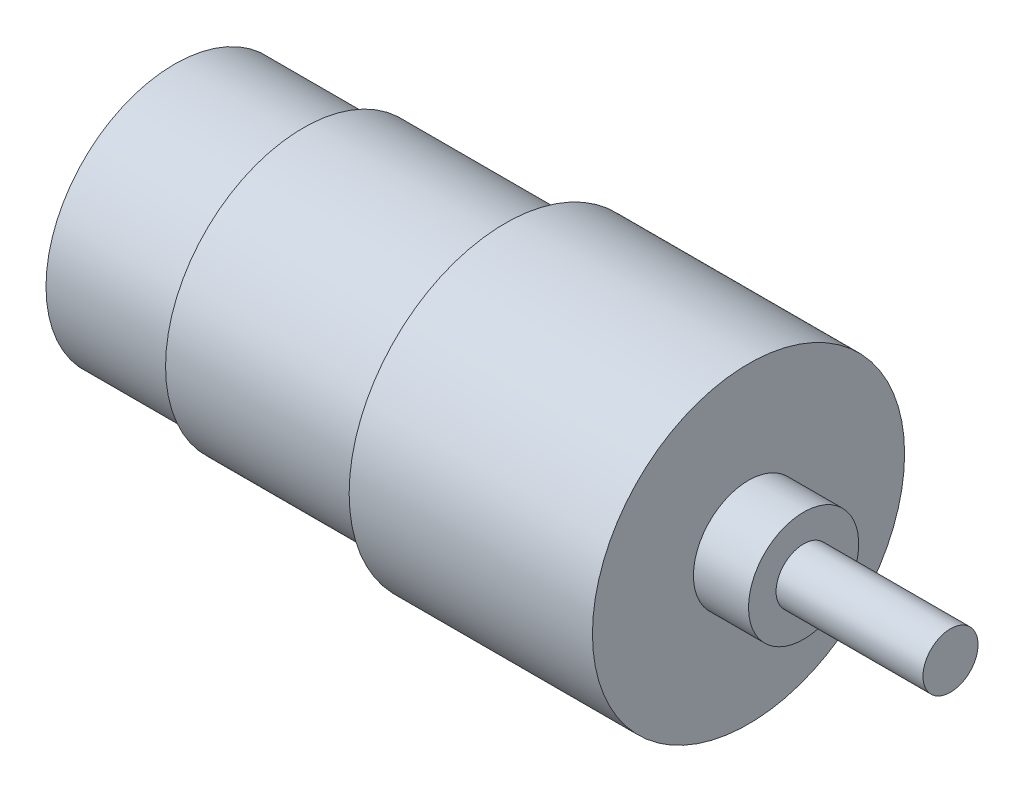
ISO-10303-21;
HEADER;
FILE_DESCRIPTION(('STEP AP214'),'2;1');
FILE_NAME('part.step','',(''),(''),'','','');
FILE_SCHEMA(('AUTOMOTIVE_DESIGN { 1 0 10303 214 1 1 1 1 }'));
ENDSEC;
DATA;
#1=APPLICATION_CONTEXT('core data for automotive mechanical design processes');
#2=APPLICATION_PROTOCOL_DEFINITION('international standard','automotive_design',2000,#1);
#3=PRODUCT_CONTEXT('',#1,'mechanical');
#4=PRODUCT('Part','Part','',(#3));
#5=PRODUCT_RELATED_PRODUCT_CATEGORY('part','',(#4));
#6=PRODUCT_DEFINITION_FORMATION('','',#4);
#7=PRODUCT_DEFINITION_CONTEXT('part definition',#1,'design');
#8=PRODUCT_DEFINITION('design','',#6,#7);
#9=PRODUCT_DEFINITION_SHAPE('','',#8);
#10=(LENGTH_UNIT() NAMED_UNIT(*) SI_UNIT(.MILLI.,.METRE.));
#11=(NAMED_UNIT(*) PLANE_ANGLE_UNIT() SI_UNIT($,.RADIAN.));
#12=(NAMED_UNIT(*) SI_UNIT($,.STERADIAN.) SOLID_ANGLE_UNIT());
#13=UNCERTAINTY_MEASURE_WITH_UNIT(LENGTH_MEASURE(1.E-05),#10,'distance_accuracy_value','');
#14=(GEOMETRIC_REPRESENTATION_CONTEXT(3) GLOBAL_UNCERTAINTY_ASSIGNED_CONTEXT((#13)) GLOBAL_UNIT_ASSIGNED_CONTEXT((#10,
#11,#12)) REPRESENTATION_CONTEXT('',''));
#15=CARTESIAN_POINT('',(0.,0.,0.));
#16=DIRECTION('',(0.,0.,1.));
#17=DIRECTION('',(1.,0.,0.));
#18=AXIS2_PLACEMENT_3D('',#15,#16,#17);
#19=CARTESIAN_POINT('',(0.,0.,0.));
#20=DIRECTION('',(1.,0.,0.));
#21=DIRECTION('',(0.,0.,-1.));
#22=AXIS2_PLACEMENT_3D('',#19,#20,#21);
#23=PLANE('',#22);
#24=CARTESIAN_POINT('',(0.,0.,0.));
#25=DIRECTION('',(-1.,0.,0.));
#26=DIRECTION('',(0.,0.,1.));
#27=AXIS2_PLACEMENT_3D('',#24,#25,#26);
#28=CIRCLE('',#27,14.);
#29=CARTESIAN_POINT('',(0.,0.,14.));
#30=VERTEX_POINT('',#29);
#31=EDGE_CURVE('E10',#30,#30,#28,.T.);
#32=ORIENTED_EDGE('',*,*,#31,.T.);
#33=EDGE_LOOP('',(#32));
#34=FACE_BOUND('',#33,.T.);
#35=ADVANCED_FACE('F37',(#34),#23,.F.);
#36=CARTESIAN_POINT('',(-18.6529126213592,0.,0.));
#37=DIRECTION('',(-1.,0.,0.));
#38=DIRECTION('',(0.,0.,1.));
#39=AXIS2_PLACEMENT_3D('',#36,#37,#38);
#40=CYLINDRICAL_SURFACE('',#39,14.);
#41=ORIENTED_EDGE('',*,*,#31,.F.);
#42=EDGE_LOOP('',(#41));
#43=FACE_BOUND('',#42,.T.);
#44=CARTESIAN_POINT('',(14.0218446601942,0.,0.));
#45=DIRECTION('',(-1.,0.,0.));
#46=DIRECTION('',(0.,0.,1.));
#47=AXIS2_PLACEMENT_3D('',#44,#45,#46);
#48=CIRCLE('',#47,14.);
#49=CARTESIAN_POINT('',(14.0218446601942,0.,14.));
#50=VERTEX_POINT('',#49);
#51=EDGE_CURVE('E44',#50,#50,#48,.T.);
#52=ORIENTED_EDGE('',*,*,#51,.T.);
#53=EDGE_LOOP('',(#52));
#54=FACE_BOUND('',#53,.T.);
#55=ADVANCED_FACE('F97',(#43,#54),#40,.T.);
#56=CARTESIAN_POINT('',(14.0218446601942,0.,-14.));
#57=DIRECTION('',(1.,0.,0.));
#58=DIRECTION('',(0.,0.,-1.));
#59=AXIS2_PLACEMENT_3D('',#56,#57,#58);
#60=PLANE('',#59);
#61=ORIENTED_EDGE('',*,*,#51,.F.);
#62=EDGE_LOOP('',(#61));
#63=FACE_BOUND('',#62,.T.);
#64=CARTESIAN_POINT('',(14.0218446601942,0.,0.));
#65=DIRECTION('',(-1.,0.,0.));
#66=DIRECTION('',(0.,0.,1.));
#67=AXIS2_PLACEMENT_3D('',#64,#65,#66);
#68=CIRCLE('',#67,15.);
#69=CARTESIAN_POINT('',(14.0218446601942,0.,15.));
#70=VERTEX_POINT('',#69);
#71=EDGE_CURVE('E49',#70,#70,#68,.T.);
#72=ORIENTED_EDGE('',*,*,#71,.T.);
#73=EDGE_LOOP('',(#72));
#74=FACE_BOUND('',#73,.T.);
#75=ADVANCED_FACE('F101',(#63,#74),#60,.F.);
#76=CARTESIAN_POINT('',(-18.6529126213592,0.,0.));
#77=DIRECTION('',(-1.,0.,0.));
#78=DIRECTION('',(0.,0.,1.));
#79=AXIS2_PLACEMENT_3D('',#76,#77,#78);
#80=CYLINDRICAL_SURFACE('',#79,15.);
#81=ORIENTED_EDGE('',*,*,#71,.F.);
#82=EDGE_LOOP('',(#81));
#83=FACE_BOUND('',#82,.T.);
#84=CARTESIAN_POINT('',(36.0194174757282,0.,0.));
#85=DIRECTION('',(-1.,0.,0.));
#86=DIRECTION('',(0.,0.,1.));
#87=AXIS2_PLACEMENT_3D('',#84,#85,#86);
#88=CIRCLE('',#87,15.);
#89=CARTESIAN_POINT('',(36.0194174757282,0.,15.));
#90=VERTEX_POINT('',#89);
#91=EDGE_CURVE('E54',#90,#90,#88,.T.);
#92=ORIENTED_EDGE('',*,*,#91,.T.);
#93=EDGE_LOOP('',(#92));
#94=FACE_BOUND('',#93,.T.);
#95=ADVANCED_FACE('F106',(#83,#94),#80,.T.);
#96=CARTESIAN_POINT('',(36.0194174757282,0.,-15.));
#97=DIRECTION('',(1.,0.,0.));
#98=DIRECTION('',(0.,0.,-1.));
#99=AXIS2_PLACEMENT_3D('',#96,#97,#98);
#100=PLANE('',#99);
#101=ORIENTED_EDGE('',*,*,#91,.F.);
#102=EDGE_LOOP('',(#101));
#103=FACE_BOUND('',#102,.T.);
#104=CARTESIAN_POINT('',(36.0194174757282,0.,0.));
#105=DIRECTION('',(-1.,0.,0.));
#106=DIRECTION('',(0.,0.,1.));
#107=AXIS2_PLACEMENT_3D('',#104,#105,#106);
#108=CIRCLE('',#107,17.);
#109=CARTESIAN_POINT('',(36.0194174757282,0.,17.));
#110=VERTEX_POINT('',#109);
#111=EDGE_CURVE('E60',#110,#110,#108,.T.);
#112=ORIENTED_EDGE('',*,*,#111,.T.);
#113=EDGE_LOOP('',(#112));
#114=FACE_BOUND('',#113,.T.);
#115=ADVANCED_FACE('F112',(#103,#114),#100,.F.);
#116=CARTESIAN_POINT('',(-18.6529126213592,0.,0.));
#117=DIRECTION('',(-1.,0.,0.));
#118=DIRECTION('',(0.,0.,1.));
#119=AXIS2_PLACEMENT_3D('',#116,#117,#118);
#120=CYLINDRICAL_SURFACE('',#119,17.);
#121=ORIENTED_EDGE('',*,*,#111,.F.);
#122=EDGE_LOOP('',(#121));
#123=FACE_BOUND('',#122,.T.);
#124=CARTESIAN_POINT('',(62.5194174757282,0.,0.));
#125=DIRECTION('',(-1.,0.,0.));
#126=DIRECTION('',(0.,0.,1.));
#127=AXIS2_PLACEMENT_3D('',#124,#125,#126);
#128=CIRCLE('',#127,17.);
#129=CARTESIAN_POINT('',(62.5194174757282,0.,17.));
#130=VERTEX_POINT('',#129);
#131=EDGE_CURVE('E64',#130,#130,#128,.T.);
#132=ORIENTED_EDGE('',*,*,#131,.T.);
#133=EDGE_LOOP('',(#132));
#134=FACE_BOUND('',#133,.T.);
#135=ADVANCED_FACE('F116',(#123,#134),#120,.T.);
#136=CARTESIAN_POINT('',(62.5194174757282,0.,-17.));
#137=DIRECTION('',(-1.,0.,0.));
#138=DIRECTION('',(0.,0.,1.));
#139=AXIS2_PLACEMENT_3D('',#136,#137,#138);
#140=PLANE('',#139);
#141=ORIENTED_EDGE('',*,*,#131,.F.);
#142=EDGE_LOOP('',(#141));
#143=FACE_BOUND('',#142,.T.);
#144=CARTESIAN_POINT('',(62.5194174757282,0.,0.));
#145=DIRECTION('',(-1.,0.,0.));
#146=DIRECTION('',(0.,0.,1.));
#147=AXIS2_PLACEMENT_3D('',#144,#145,#146);
#148=CIRCLE('',#147,6.);
#149=CARTESIAN_POINT('',(62.5194174757282,0.,6.));
#150=VERTEX_POINT('',#149);
#151=EDGE_CURVE('E68',#150,#150,#148,.T.);
#152=ORIENTED_EDGE('',*,*,#151,.T.);
#153=EDGE_LOOP('',(#152));
#154=FACE_BOUND('',#153,.T.);
#155=ADVANCED_FACE('F120',(#143,#154),#140,.F.);
#156=CARTESIAN_POINT('',(-18.6529126213592,0.,0.));
#157=DIRECTION('',(-1.,0.,0.));
#158=DIRECTION('',(0.,0.,1.));
#159=AXIS2_PLACEMENT_3D('',#156,#157,#158);
#160=CYLINDRICAL_SURFACE('',#159,6.);
#161=ORIENTED_EDGE('',*,*,#151,.F.);
#162=EDGE_LOOP('',(#161));
#163=FACE_BOUND('',#162,.T.);
#164=CARTESIAN_POINT('',(68.5194174757282,0.,0.));
#165=DIRECTION('',(-1.,0.,0.));
#166=DIRECTION('',(0.,0.,1.));
#167=AXIS2_PLACEMENT_3D('',#164,#165,#166);
#168=CIRCLE('',#167,6.);
#169=CARTESIAN_POINT('',(68.5194174757282,0.,6.));
#170=VERTEX_POINT('',#169);
#171=EDGE_CURVE('E72',#170,#170,#168,.T.);
#172=ORIENTED_EDGE('',*,*,#171,.T.);
#173=EDGE_LOOP('',(#172));
#174=FACE_BOUND('',#173,.T.);
#175=ADVANCED_FACE('F124',(#163,#174),#160,.T.);
#176=CARTESIAN_POINT('',(68.5194174757282,0.,-6.));
#177=DIRECTION('',(-1.,0.,0.));
#178=DIRECTION('',(0.,0.,1.));
#179=AXIS2_PLACEMENT_3D('',#176,#177,#178);
#180=PLANE('',#179);
#181=ORIENTED_EDGE('',*,*,#171,.F.);
#182=EDGE_LOOP('',(#181));
#183=FACE_BOUND('',#182,.T.);
#184=CARTESIAN_POINT('',(68.5194174757282,0.,0.));
#185=DIRECTION('',(-1.,0.,0.));
#186=DIRECTION('',(0.,0.,1.));
#187=AXIS2_PLACEMENT_3D('',#184,#185,#186);
#188=CIRCLE('',#187,3.);
#189=CARTESIAN_POINT('',(68.5194174757282,0.,3.));
#190=VERTEX_POINT('',#189);
#191=EDGE_CURVE('E76',#190,#190,#188,.T.);
#192=ORIENTED_EDGE('',*,*,#191,.T.);
#193=EDGE_LOOP('',(#192));
#194=FACE_BOUND('',#193,.T.);
#195=ADVANCED_FACE('F93',(#183,#194),#180,.F.);
#196=CARTESIAN_POINT('',(-18.6529126213592,0.,0.));
#197=DIRECTION('',(-1.,0.,0.));
#198=DIRECTION('',(0.,0.,1.));
#199=AXIS2_PLACEMENT_3D('',#196,#197,#198);
#200=CYLINDRICAL_SURFACE('',#199,3.);
#201=ORIENTED_EDGE('',*,*,#191,.F.);
#202=EDGE_LOOP('',(#201));
#203=FACE_BOUND('',#202,.T.);
#204=CARTESIAN_POINT('',(84.5194174757282,0.,0.));
#205=DIRECTION('',(-1.,0.,0.));
#206=DIRECTION('',(0.,0.,1.));
#207=AXIS2_PLACEMENT_3D('',#204,#205,#206);
#208=CIRCLE('',#207,3.);
#209=CARTESIAN_POINT('',(84.5194174757282,0.,3.));
#210=VERTEX_POINT('',#209);
#211=EDGE_CURVE('E80',#210,#210,#208,.T.);
#212=ORIENTED_EDGE('',*,*,#211,.T.);
#213=EDGE_LOOP('',(#212));
#214=FACE_BOUND('',#213,.T.);
#215=ADVANCED_FACE('F85',(#203,#214),#200,.T.);
#216=CARTESIAN_POINT('',(84.5194174757282,0.,-3.));
#217=DIRECTION('',(-1.,0.,0.));
#218=DIRECTION('',(0.,0.,1.));
#219=AXIS2_PLACEMENT_3D('',#216,#217,#218);
#220=PLANE('',#219);
#221=ORIENTED_EDGE('',*,*,#211,.F.);
#222=EDGE_LOOP('',(#221));
#223=FACE_BOUND('',#222,.T.);
#224=ADVANCED_FACE('F87',(#223),#220,.F.);
#225=CLOSED_SHELL('',(#35,#55,#75,#95,#115,#135,#155,#175,#195,#215,#224));
#226=MANIFOLD_SOLID_BREP('B2',#225);
#227=ADVANCED_BREP_SHAPE_REPRESENTATION('',(#18,#226),#14);
#228=SHAPE_DEFINITION_REPRESENTATION(#9,#227);
ENDSEC;
END-ISO-10303-21;
